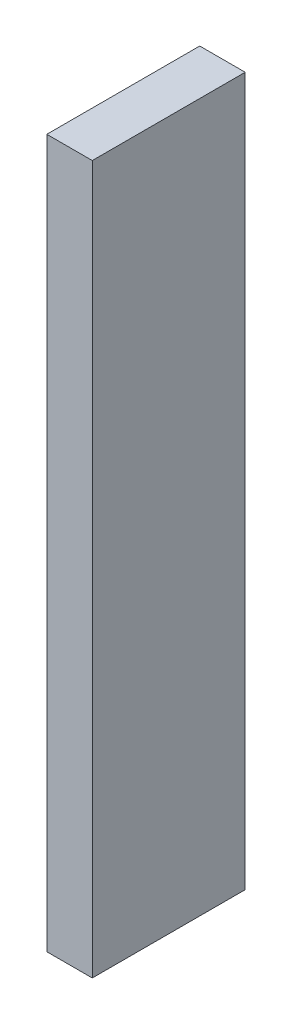
ISO-10303-21;
HEADER;
FILE_DESCRIPTION(('STEP AP214'),'2;1');
FILE_NAME('part.step','',(''),(''),'','','');
FILE_SCHEMA(('AUTOMOTIVE_DESIGN { 1 0 10303 214 1 1 1 1 }'));
ENDSEC;
DATA;
#1=APPLICATION_CONTEXT('core data for automotive mechanical design processes');
#2=APPLICATION_PROTOCOL_DEFINITION('international standard','automotive_design',2000,#1);
#3=PRODUCT_CONTEXT('',#1,'mechanical');
#4=PRODUCT('Part','Part','',(#3));
#5=PRODUCT_RELATED_PRODUCT_CATEGORY('part','',(#4));
#6=PRODUCT_DEFINITION_FORMATION('','',#4);
#7=PRODUCT_DEFINITION_CONTEXT('part definition',#1,'design');
#8=PRODUCT_DEFINITION('design','',#6,#7);
#9=PRODUCT_DEFINITION_SHAPE('','',#8);
#10=(LENGTH_UNIT() NAMED_UNIT(*) SI_UNIT(.MILLI.,.METRE.));
#11=(NAMED_UNIT(*) PLANE_ANGLE_UNIT() SI_UNIT($,.RADIAN.));
#12=(NAMED_UNIT(*) SI_UNIT($,.STERADIAN.) SOLID_ANGLE_UNIT());
#13=UNCERTAINTY_MEASURE_WITH_UNIT(LENGTH_MEASURE(1.E-05),#10,'distance_accuracy_value','');
#14=(GEOMETRIC_REPRESENTATION_CONTEXT(3) GLOBAL_UNCERTAINTY_ASSIGNED_CONTEXT((#13)) GLOBAL_UNIT_ASSIGNED_CONTEXT((#10,
#11,#12)) REPRESENTATION_CONTEXT('',''));
#15=CARTESIAN_POINT('',(0.,0.,0.));
#16=DIRECTION('',(0.,0.,1.));
#17=DIRECTION('',(1.,0.,0.));
#18=AXIS2_PLACEMENT_3D('',#15,#16,#17);
#19=CARTESIAN_POINT('',(130.275545195554,22.4180708263693,96.072028202897));
#20=DIRECTION('',(-1.69244514382854E-09,0.,1.));
#21=DIRECTION('',(1.,0.,1.69244514382854E-09));
#22=AXIS2_PLACEMENT_3D('',#19,#20,#21);
#23=PLANE('',#22);
#24=DIRECTION('',(0.,-1.,0.));
#25=VECTOR('',#24,1.);
#26=CARTESIAN_POINT('',(131.258630292567,22.4180708263693,96.0720282045608));
#27=LINE('',#26,#25);
#28=CARTESIAN_POINT('',(131.258630292567,22.4180708263693,96.0720282045608));
#29=VERTEX_POINT('',#28);
#30=CARTESIAN_POINT('',(131.258630292567,7.11212965552236,96.0720282045608));
#31=VERTEX_POINT('',#30);
#32=EDGE_CURVE('E79',#29,#31,#27,.T.);
#33=ORIENTED_EDGE('',*,*,#32,.F.);
#34=DIRECTION('',(1.,0.,1.69244514382854E-09));
#35=VECTOR('',#34,1.);
#36=CARTESIAN_POINT('',(130.275545195554,22.4180708263693,96.072028202897));
#37=LINE('',#36,#35);
#38=CARTESIAN_POINT('',(130.275545195554,22.4180708263693,96.072028202897));
#39=VERTEX_POINT('',#38);
#40=EDGE_CURVE('E32',#39,#29,#37,.T.);
#41=ORIENTED_EDGE('',*,*,#40,.F.);
#42=DIRECTION('',(0.,-1.,0.));
#43=VECTOR('',#42,1.);
#44=CARTESIAN_POINT('',(130.275545195554,22.4180708263693,96.072028202897));
#45=LINE('',#44,#43);
#46=CARTESIAN_POINT('',(130.275545195554,7.11212965552236,96.072028202897));
#47=VERTEX_POINT('',#46);
#48=EDGE_CURVE('E71',#39,#47,#45,.T.);
#49=ORIENTED_EDGE('',*,*,#48,.T.);
#50=DIRECTION('',(1.,0.,1.69244514382854E-09));
#51=VECTOR('',#50,1.);
#52=CARTESIAN_POINT('',(130.275545195554,7.11212965552236,96.072028202897));
#53=LINE('',#52,#51);
#54=EDGE_CURVE('E10',#47,#31,#53,.T.);
#55=ORIENTED_EDGE('',*,*,#54,.T.);
#56=EDGE_LOOP('',(#33,#41,#49,#55));
#57=FACE_BOUND('',#56,.T.);
#58=ADVANCED_FACE('F16',(#57),#23,.T.);
#59=CARTESIAN_POINT('',(130.275545195554,7.11212965552236,96.072028202897));
#60=DIRECTION('',(0.,-1.,0.));
#61=DIRECTION('',(0.,0.,-1.));
#62=AXIS2_PLACEMENT_3D('',#59,#60,#61);
#63=PLANE('',#62);
#64=DIRECTION('',(1.69244514382854E-09,0.,-1.));
#65=VECTOR('',#64,1.);
#66=CARTESIAN_POINT('',(131.258630292567,7.11212965552236,96.0720282045608));
#67=LINE('',#66,#65);
#68=CARTESIAN_POINT('',(131.258630298163,7.11212965552235,92.766087033712));
#69=VERTEX_POINT('',#68);
#70=EDGE_CURVE('E82',#31,#69,#67,.T.);
#71=ORIENTED_EDGE('',*,*,#70,.F.);
#72=ORIENTED_EDGE('',*,*,#54,.F.);
#73=DIRECTION('',(1.69244514382854E-09,0.,-1.));
#74=VECTOR('',#73,1.);
#75=CARTESIAN_POINT('',(130.275545195554,7.11212965552236,96.072028202897));
#76=LINE('',#75,#74);
#77=CARTESIAN_POINT('',(130.27554520115,7.11212965552235,92.7660870320482));
#78=VERTEX_POINT('',#77);
#79=EDGE_CURVE('E67',#47,#78,#76,.T.);
#80=ORIENTED_EDGE('',*,*,#79,.T.);
#81=DIRECTION('',(1.,0.,1.69244514382854E-09));
#82=VECTOR('',#81,1.);
#83=CARTESIAN_POINT('',(130.27554520115,7.11212965552235,92.7660870320482));
#84=LINE('',#83,#82);
#85=EDGE_CURVE('E24',#78,#69,#84,.T.);
#86=ORIENTED_EDGE('',*,*,#85,.T.);
#87=EDGE_LOOP('',(#71,#72,#80,#86));
#88=FACE_BOUND('',#87,.T.);
#89=ADVANCED_FACE('F68',(#88),#63,.T.);
#90=CARTESIAN_POINT('',(130.27554520115,7.11212965552235,92.7660870320482));
#91=DIRECTION('',(1.69244514382854E-09,0.,-1.));
#92=DIRECTION('',(-1.,0.,-1.69244514382854E-09));
#93=AXIS2_PLACEMENT_3D('',#90,#91,#92);
#94=PLANE('',#93);
#95=DIRECTION('',(0.,1.,0.));
#96=VECTOR('',#95,1.);
#97=CARTESIAN_POINT('',(131.258630298163,7.11212965552235,92.766087033712));
#98=LINE('',#97,#96);
#99=CARTESIAN_POINT('',(131.258630298163,22.418070826371,92.7660870252515));
#100=VERTEX_POINT('',#99);
#101=EDGE_CURVE('E65',#69,#100,#98,.T.);
#102=ORIENTED_EDGE('',*,*,#101,.F.);
#103=ORIENTED_EDGE('',*,*,#85,.F.);
#104=DIRECTION('',(0.,1.,0.));
#105=VECTOR('',#104,1.);
#106=CARTESIAN_POINT('',(130.27554520115,7.11212965552235,92.7660870320482));
#107=LINE('',#106,#105);
#108=CARTESIAN_POINT('',(130.27554520115,22.418070826371,92.7660870235877));
#109=VERTEX_POINT('',#108);
#110=EDGE_CURVE('E62',#78,#109,#107,.T.);
#111=ORIENTED_EDGE('',*,*,#110,.T.);
#112=DIRECTION('',(1.,0.,1.69244514382854E-09));
#113=VECTOR('',#112,1.);
#114=CARTESIAN_POINT('',(130.27554520115,22.418070826371,92.7660870235877));
#115=LINE('',#114,#113);
#116=EDGE_CURVE('E48',#109,#100,#115,.T.);
#117=ORIENTED_EDGE('',*,*,#116,.T.);
#118=EDGE_LOOP('',(#102,#103,#111,#117));
#119=FACE_BOUND('',#118,.T.);
#120=ADVANCED_FACE('F60',(#119),#94,.T.);
#121=CARTESIAN_POINT('',(130.27554520115,22.418070826371,92.7660870235877));
#122=DIRECTION('',(0.,1.,0.));
#123=DIRECTION('',(-1.,0.,0.));
#124=AXIS2_PLACEMENT_3D('',#121,#122,#123);
#125=PLANE('',#124);
#126=DIRECTION('',(-1.69244514382854E-09,0.,1.));
#127=VECTOR('',#126,1.);
#128=CARTESIAN_POINT('',(131.258630298163,22.418070826371,92.7660870252515));
#129=LINE('',#128,#127);
#130=EDGE_CURVE('E85',#100,#29,#129,.T.);
#131=ORIENTED_EDGE('',*,*,#130,.F.);
#132=ORIENTED_EDGE('',*,*,#116,.F.);
#133=DIRECTION('',(-1.69244514382854E-09,0.,1.));
#134=VECTOR('',#133,1.);
#135=CARTESIAN_POINT('',(130.27554520115,22.418070826371,92.7660870235877));
#136=LINE('',#135,#134);
#137=EDGE_CURVE('E74',#109,#39,#136,.T.);
#138=ORIENTED_EDGE('',*,*,#137,.T.);
#139=ORIENTED_EDGE('',*,*,#40,.T.);
#140=EDGE_LOOP('',(#131,#132,#138,#139));
#141=FACE_BOUND('',#140,.T.);
#142=ADVANCED_FACE('F96',(#141),#125,.T.);
#143=CARTESIAN_POINT('',(130.275545201028,17.2651002409467,92.8378644340291));
#144=DIRECTION('',(1.,0.,1.69244514382854E-09));
#145=DIRECTION('',(0.,1.,0.));
#146=AXIS2_PLACEMENT_3D('',#143,#144,#145);
#147=PLANE('',#146);
#148=ORIENTED_EDGE('',*,*,#48,.F.);
#149=ORIENTED_EDGE('',*,*,#137,.F.);
#150=ORIENTED_EDGE('',*,*,#110,.F.);
#151=ORIENTED_EDGE('',*,*,#79,.F.);
#152=EDGE_LOOP('',(#148,#149,#150,#151));
#153=FACE_BOUND('',#152,.T.);
#154=ADVANCED_FACE('F73',(#153),#147,.F.);
#155=CARTESIAN_POINT('',(131.258630298041,17.2651002409467,92.8378644356929));
#156=DIRECTION('',(1.,0.,1.69244514382854E-09));
#157=DIRECTION('',(0.,1.,0.));
#158=AXIS2_PLACEMENT_3D('',#155,#156,#157);
#159=PLANE('',#158);
#160=ORIENTED_EDGE('',*,*,#32,.T.);
#161=ORIENTED_EDGE('',*,*,#70,.T.);
#162=ORIENTED_EDGE('',*,*,#101,.T.);
#163=ORIENTED_EDGE('',*,*,#130,.T.);
#164=EDGE_LOOP('',(#160,#161,#162,#163));
#165=FACE_BOUND('',#164,.T.);
#166=ADVANCED_FACE('F89',(#165),#159,.T.);
#167=CLOSED_SHELL('',(#58,#89,#120,#142,#154,#166));
#168=MANIFOLD_SOLID_BREP('B1',#167);
#169=ADVANCED_BREP_SHAPE_REPRESENTATION('',(#18,#168),#14);
#170=SHAPE_DEFINITION_REPRESENTATION(#9,#169);
ENDSEC;
END-ISO-10303-21;
